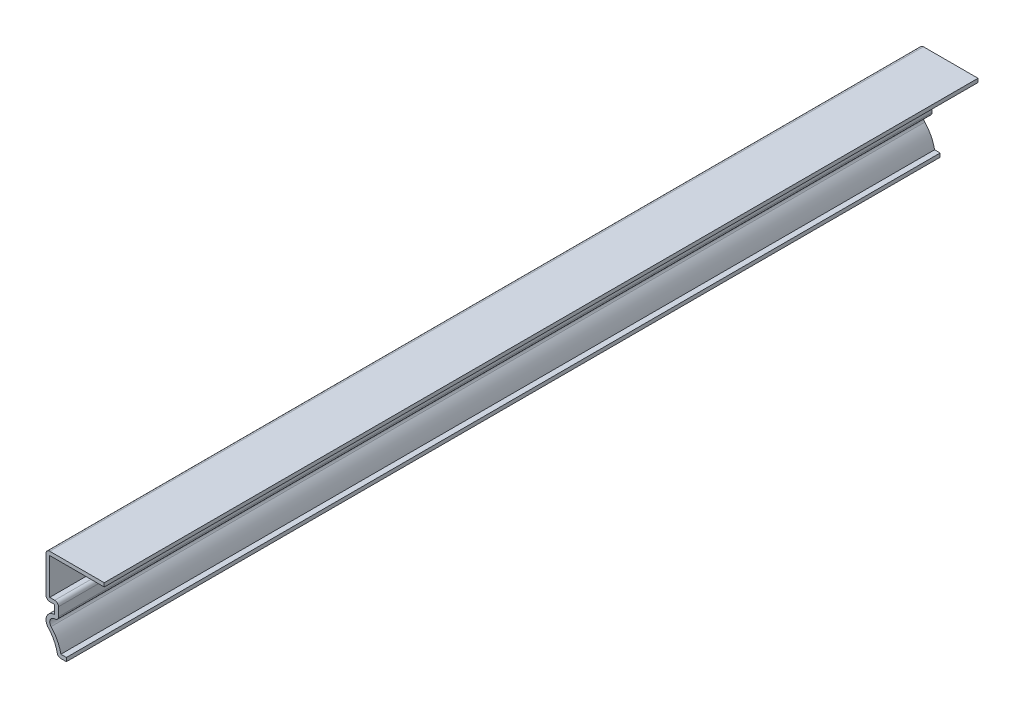
ISO-10303-21;
HEADER;
FILE_DESCRIPTION(('STEP AP214'),'2;1');
FILE_NAME('part.step','',(''),(''),'','','');
FILE_SCHEMA(('AUTOMOTIVE_DESIGN { 1 0 10303 214 1 1 1 1 }'));
ENDSEC;
DATA;
#1=APPLICATION_CONTEXT('core data for automotive mechanical design processes');
#2=APPLICATION_PROTOCOL_DEFINITION('international standard','automotive_design',2000,#1);
#3=PRODUCT_CONTEXT('',#1,'mechanical');
#4=PRODUCT('Part','Part','',(#3));
#5=PRODUCT_RELATED_PRODUCT_CATEGORY('part','',(#4));
#6=PRODUCT_DEFINITION_FORMATION('','',#4);
#7=PRODUCT_DEFINITION_CONTEXT('part definition',#1,'design');
#8=PRODUCT_DEFINITION('design','',#6,#7);
#9=PRODUCT_DEFINITION_SHAPE('','',#8);
#10=(LENGTH_UNIT() NAMED_UNIT(*) SI_UNIT(.MILLI.,.METRE.));
#11=(NAMED_UNIT(*) PLANE_ANGLE_UNIT() SI_UNIT($,.RADIAN.));
#12=(NAMED_UNIT(*) SI_UNIT($,.STERADIAN.) SOLID_ANGLE_UNIT());
#13=UNCERTAINTY_MEASURE_WITH_UNIT(LENGTH_MEASURE(1.E-05),#10,'distance_accuracy_value','');
#14=(GEOMETRIC_REPRESENTATION_CONTEXT(3) GLOBAL_UNCERTAINTY_ASSIGNED_CONTEXT((#13)) GLOBAL_UNIT_ASSIGNED_CONTEXT((#10,
#11,#12)) REPRESENTATION_CONTEXT('',''));
#15=CARTESIAN_POINT('',(0.,0.,0.));
#16=DIRECTION('',(0.,0.,1.));
#17=DIRECTION('',(1.,0.,0.));
#18=AXIS2_PLACEMENT_3D('',#15,#16,#17);
#19=CARTESIAN_POINT('',(0.,22.7965,-238.125));
#20=DIRECTION('',(0.,-1.,0.));
#21=DIRECTION('',(0.,0.,-1.));
#22=AXIS2_PLACEMENT_3D('',#19,#20,#21);
#23=PLANE('',#22);
#24=DIRECTION('',(1.,0.,0.));
#25=VECTOR('',#24,1.);
#26=CARTESIAN_POINT('',(0.,22.7965,0.));
#27=LINE('',#26,#25);
#28=CARTESIAN_POINT('',(-14.859,22.7965,0.));
#29=VERTEX_POINT('',#28);
#30=CARTESIAN_POINT('',(0.,22.7965,0.));
#31=VERTEX_POINT('',#30);
#32=EDGE_CURVE('E241',#29,#31,#27,.T.);
#33=ORIENTED_EDGE('',*,*,#32,.F.);
#34=DIRECTION('',(0.,0.,1.));
#35=VECTOR('',#34,1.);
#36=CARTESIAN_POINT('',(-14.859,22.7965,-238.125));
#37=LINE('',#36,#35);
#38=CARTESIAN_POINT('',(-14.859,22.7965,-238.125));
#39=VERTEX_POINT('',#38);
#40=EDGE_CURVE('E203',#39,#29,#37,.T.);
#41=ORIENTED_EDGE('',*,*,#40,.F.);
#42=DIRECTION('',(1.,0.,0.));
#43=VECTOR('',#42,1.);
#44=CARTESIAN_POINT('',(0.,22.7965,-238.125));
#45=LINE('',#44,#43);
#46=CARTESIAN_POINT('',(0.,22.7965,-238.125));
#47=VERTEX_POINT('',#46);
#48=EDGE_CURVE('E185',#39,#47,#45,.T.);
#49=ORIENTED_EDGE('',*,*,#48,.T.);
#50=DIRECTION('',(0.,0.,1.));
#51=VECTOR('',#50,1.);
#52=CARTESIAN_POINT('',(0.,22.7965,-238.125));
#53=LINE('',#52,#51);
#54=EDGE_CURVE('E193',#47,#31,#53,.T.);
#55=ORIENTED_EDGE('',*,*,#54,.T.);
#56=EDGE_LOOP('',(#33,#41,#49,#55));
#57=FACE_BOUND('',#56,.T.);
#58=ADVANCED_FACE('F35',(#57),#23,.T.);
#59=CARTESIAN_POINT('',(-14.859,23.8125,-238.125));
#60=DIRECTION('',(1.,0.,0.));
#61=DIRECTION('',(0.,1.,0.));
#62=AXIS2_PLACEMENT_3D('',#59,#60,#61);
#63=PLANE('',#62);
#64=DIRECTION('',(0.,1.,0.));
#65=VECTOR('',#64,1.);
#66=CARTESIAN_POINT('',(-14.859,23.8125,0.));
#67=LINE('',#66,#65);
#68=CARTESIAN_POINT('',(-14.859,12.92225,0.));
#69=VERTEX_POINT('',#68);
#70=EDGE_CURVE('E204',#69,#29,#67,.T.);
#71=ORIENTED_EDGE('',*,*,#70,.F.);
#72=DIRECTION('',(0.,0.,1.));
#73=VECTOR('',#72,1.);
#74=CARTESIAN_POINT('',(-14.859,12.92225,-238.125));
#75=LINE('',#74,#73);
#76=CARTESIAN_POINT('',(-14.859,12.92225,-238.125));
#77=VERTEX_POINT('',#76);
#78=EDGE_CURVE('E277',#77,#69,#75,.T.);
#79=ORIENTED_EDGE('',*,*,#78,.F.);
#80=DIRECTION('',(0.,1.,0.));
#81=VECTOR('',#80,1.);
#82=CARTESIAN_POINT('',(-14.859,23.8125,-238.125));
#83=LINE('',#82,#81);
#84=EDGE_CURVE('E201',#77,#39,#83,.T.);
#85=ORIENTED_EDGE('',*,*,#84,.T.);
#86=ORIENTED_EDGE('',*,*,#40,.T.);
#87=EDGE_LOOP('',(#71,#79,#85,#86));
#88=FACE_BOUND('',#87,.T.);
#89=ADVANCED_FACE('F415',(#88),#63,.T.);
#90=CARTESIAN_POINT('',(-15.875,12.92225,-238.125));
#91=DIRECTION('',(0.,1.,0.));
#92=DIRECTION('',(0.,0.,1.));
#93=AXIS2_PLACEMENT_3D('',#90,#91,#92);
#94=PLANE('',#93);
#95=DIRECTION('',(1.,0.,0.));
#96=VECTOR('',#95,1.);
#97=CARTESIAN_POINT('',(-15.875,12.92225,0.));
#98=LINE('',#97,#96);
#99=CARTESIAN_POINT('',(-13.49375,12.92225,0.));
#100=VERTEX_POINT('',#99);
#101=EDGE_CURVE('E207',#100,#69,#98,.F.);
#102=ORIENTED_EDGE('',*,*,#101,.F.);
#103=DIRECTION('',(0.,0.,1.));
#104=VECTOR('',#103,1.);
#105=CARTESIAN_POINT('',(-13.49375,12.92225,-238.125));
#106=LINE('',#105,#104);
#107=CARTESIAN_POINT('',(-13.49375,12.92225,-238.125));
#108=VERTEX_POINT('',#107);
#109=EDGE_CURVE('E43',#100,#108,#106,.F.);
#110=ORIENTED_EDGE('',*,*,#109,.T.);
#111=DIRECTION('',(1.,0.,0.));
#112=VECTOR('',#111,1.);
#113=CARTESIAN_POINT('',(-15.875,12.92225,-238.125));
#114=LINE('',#113,#112);
#115=EDGE_CURVE('E238',#108,#77,#114,.F.);
#116=ORIENTED_EDGE('',*,*,#115,.T.);
#117=ORIENTED_EDGE('',*,*,#78,.T.);
#118=EDGE_LOOP('',(#102,#110,#116,#117));
#119=FACE_BOUND('',#118,.T.);
#120=ADVANCED_FACE('F339',(#119),#94,.T.);
#121=CARTESIAN_POINT('',(-12.47775,11.90625,-238.125));
#122=DIRECTION('',(1.,0.,0.));
#123=DIRECTION('',(0.,1.,0.));
#124=AXIS2_PLACEMENT_3D('',#121,#122,#123);
#125=PLANE('',#124);
#126=DIRECTION('',(0.,1.,0.));
#127=VECTOR('',#126,1.);
#128=CARTESIAN_POINT('',(-12.47775,11.90625,0.));
#129=LINE('',#128,#127);
#130=CARTESIAN_POINT('',(-12.47775,9.525,0.));
#131=VERTEX_POINT('',#130);
#132=CARTESIAN_POINT('',(-12.47775,11.90625,0.));
#133=VERTEX_POINT('',#132);
#134=EDGE_CURVE('E271',#131,#133,#129,.T.);
#135=ORIENTED_EDGE('',*,*,#134,.F.);
#136=DIRECTION('',(0.,0.,1.));
#137=VECTOR('',#136,1.);
#138=CARTESIAN_POINT('',(-12.47775,9.525,-238.125));
#139=LINE('',#138,#137);
#140=CARTESIAN_POINT('',(-12.47775,9.525,-238.125));
#141=VERTEX_POINT('',#140);
#142=EDGE_CURVE('E328',#131,#141,#139,.F.);
#143=ORIENTED_EDGE('',*,*,#142,.T.);
#144=DIRECTION('',(0.,1.,0.));
#145=VECTOR('',#144,1.);
#146=CARTESIAN_POINT('',(-12.47775,11.90625,-238.125));
#147=LINE('',#146,#145);
#148=CARTESIAN_POINT('',(-12.47775,11.90625,-238.125));
#149=VERTEX_POINT('',#148);
#150=EDGE_CURVE('E235',#141,#149,#147,.T.);
#151=ORIENTED_EDGE('',*,*,#150,.T.);
#152=DIRECTION('',(0.,0.,1.));
#153=VECTOR('',#152,1.);
#154=CARTESIAN_POINT('',(-12.47775,11.90625,-238.125));
#155=LINE('',#154,#153);
#156=EDGE_CURVE('E325',#149,#133,#155,.T.);
#157=ORIENTED_EDGE('',*,*,#156,.T.);
#158=EDGE_LOOP('',(#135,#143,#151,#157));
#159=FACE_BOUND('',#158,.T.);
#160=ADVANCED_FACE('F348',(#159),#125,.T.);
#161=CARTESIAN_POINT('',(-13.49375,7.14374999999999,-238.125));
#162=DIRECTION('',(0.,0.,1.));
#163=DIRECTION('',(1.,0.,0.));
#164=AXIS2_PLACEMENT_3D('',#161,#162,#163);
#165=CYLINDRICAL_SURFACE('',#164,1.36525);
#166=CARTESIAN_POINT('',(-13.49375,7.14374999999999,-238.125));
#167=DIRECTION('',(0.,0.,1.));
#168=DIRECTION('',(1.,0.,0.));
#169=AXIS2_PLACEMENT_3D('',#166,#167,#168);
#170=CIRCLE('',#169,1.36525);
#171=CARTESIAN_POINT('',(-14.488796636598,6.20898278111873,-238.125));
#172=VERTEX_POINT('',#171);
#173=CARTESIAN_POINT('',(-13.49375,8.509,-238.125));
#174=VERTEX_POINT('',#173);
#175=EDGE_CURVE('E232',#172,#174,#170,.F.);
#176=ORIENTED_EDGE('',*,*,#175,.T.);
#177=DIRECTION('',(0.,0.,1.));
#178=VECTOR('',#177,1.);
#179=CARTESIAN_POINT('',(-13.49375,8.509,-238.125));
#180=LINE('',#179,#178);
#181=CARTESIAN_POINT('',(-13.49375,8.509,0.));
#182=VERTEX_POINT('',#181);
#183=EDGE_CURVE('E322',#174,#182,#180,.T.);
#184=ORIENTED_EDGE('',*,*,#183,.T.);
#185=CARTESIAN_POINT('',(-13.49375,7.14374999999999,0.));
#186=DIRECTION('',(0.,0.,1.));
#187=DIRECTION('',(1.,0.,0.));
#188=AXIS2_PLACEMENT_3D('',#185,#186,#187);
#189=CIRCLE('',#188,1.36525);
#190=CARTESIAN_POINT('',(-14.488796636598,6.20898278111873,0.));
#191=VERTEX_POINT('',#190);
#192=EDGE_CURVE('E268',#191,#182,#189,.F.);
#193=ORIENTED_EDGE('',*,*,#192,.F.);
#194=DIRECTION('',(0.,0.,1.));
#195=VECTOR('',#194,1.);
#196=CARTESIAN_POINT('',(-14.488796636598,6.20898278111873,-238.125));
#197=LINE('',#196,#195);
#198=EDGE_CURVE('E280',#172,#191,#197,.T.);
#199=ORIENTED_EDGE('',*,*,#198,.F.);
#200=EDGE_LOOP('',(#176,#184,#193,#199));
#201=FACE_BOUND('',#200,.T.);
#202=ADVANCED_FACE('F359',(#201),#165,.F.);
#203=CARTESIAN_POINT('',(-22.1714822959128,-1.00828969954588,-238.125));
#204=DIRECTION('',(0.,0.,1.));
#205=DIRECTION('',(1.,0.,0.));
#206=AXIS2_PLACEMENT_3D('',#203,#204,#205);
#207=CYLINDRICAL_SURFACE('',#206,10.541);
#208=CARTESIAN_POINT('',(-22.1714822959128,-1.00828969954588,0.));
#209=DIRECTION('',(0.,0.,1.));
#210=DIRECTION('',(1.,0.,0.));
#211=AXIS2_PLACEMENT_3D('',#208,#209,#210);
#212=CIRCLE('',#211,10.541);
#213=CARTESIAN_POINT('',(-11.8266801125788,1.016,0.));
#214=VERTEX_POINT('',#213);
#215=EDGE_CURVE('E265',#214,#191,#212,.T.);
#216=ORIENTED_EDGE('',*,*,#215,.F.);
#217=DIRECTION('',(0.,0.,1.));
#218=VECTOR('',#217,1.);
#219=CARTESIAN_POINT('',(-11.8266801125788,1.016,-238.125));
#220=LINE('',#219,#218);
#221=CARTESIAN_POINT('',(-11.8266801125788,1.016,-238.125));
#222=VERTEX_POINT('',#221);
#223=EDGE_CURVE('E282',#222,#214,#220,.T.);
#224=ORIENTED_EDGE('',*,*,#223,.F.);
#225=CARTESIAN_POINT('',(-22.1714822959128,-1.00828969954588,-238.125));
#226=DIRECTION('',(0.,0.,1.));
#227=DIRECTION('',(1.,0.,0.));
#228=AXIS2_PLACEMENT_3D('',#225,#226,#227);
#229=CIRCLE('',#228,10.541);
#230=EDGE_CURVE('E229',#222,#172,#229,.T.);
#231=ORIENTED_EDGE('',*,*,#230,.T.);
#232=ORIENTED_EDGE('',*,*,#198,.T.);
#233=EDGE_LOOP('',(#216,#224,#231,#232));
#234=FACE_BOUND('',#233,.T.);
#235=ADVANCED_FACE('F365',(#234),#207,.T.);
#236=CARTESIAN_POINT('',(-10.31875,1.016,-238.125));
#237=DIRECTION('',(0.,1.,0.));
#238=DIRECTION('',(-1.,0.,0.));
#239=AXIS2_PLACEMENT_3D('',#236,#237,#238);
#240=PLANE('',#239);
#241=DIRECTION('',(-1.,0.,0.));
#242=VECTOR('',#241,1.);
#243=CARTESIAN_POINT('',(-10.31875,1.016,0.));
#244=LINE('',#243,#242);
#245=CARTESIAN_POINT('',(-10.31875,1.016,0.));
#246=VERTEX_POINT('',#245);
#247=EDGE_CURVE('E262',#246,#214,#244,.T.);
#248=ORIENTED_EDGE('',*,*,#247,.F.);
#249=DIRECTION('',(0.,0.,1.));
#250=VECTOR('',#249,1.);
#251=CARTESIAN_POINT('',(-10.31875,1.016,-238.125));
#252=LINE('',#251,#250);
#253=CARTESIAN_POINT('',(-10.31875,1.016,-238.125));
#254=VERTEX_POINT('',#253);
#255=EDGE_CURVE('E284',#254,#246,#252,.T.);
#256=ORIENTED_EDGE('',*,*,#255,.F.);
#257=DIRECTION('',(-1.,0.,0.));
#258=VECTOR('',#257,1.);
#259=CARTESIAN_POINT('',(-10.31875,1.016,-238.125));
#260=LINE('',#259,#258);
#261=EDGE_CURVE('E226',#254,#222,#260,.T.);
#262=ORIENTED_EDGE('',*,*,#261,.T.);
#263=ORIENTED_EDGE('',*,*,#223,.T.);
#264=EDGE_LOOP('',(#248,#256,#262,#263));
#265=FACE_BOUND('',#264,.T.);
#266=ADVANCED_FACE('F368',(#265),#240,.T.);
#267=CARTESIAN_POINT('',(-10.31875,1.016,-238.125));
#268=DIRECTION('',(-1.,0.,0.));
#269=DIRECTION('',(0.,0.,1.));
#270=AXIS2_PLACEMENT_3D('',#267,#268,#269);
#271=PLANE('',#270);
#272=DIRECTION('',(0.,-1.,0.));
#273=VECTOR('',#272,1.);
#274=CARTESIAN_POINT('',(-10.31875,1.016,0.));
#275=LINE('',#274,#273);
#276=CARTESIAN_POINT('',(-10.31875,0.,0.));
#277=VERTEX_POINT('',#276);
#278=EDGE_CURVE('E260',#246,#277,#275,.T.);
#279=ORIENTED_EDGE('',*,*,#278,.T.);
#280=DIRECTION('',(0.,0.,1.));
#281=VECTOR('',#280,1.);
#282=CARTESIAN_POINT('',(-10.31875,0.,-238.125));
#283=LINE('',#282,#281);
#284=CARTESIAN_POINT('',(-10.31875,0.,-238.125));
#285=VERTEX_POINT('',#284);
#286=EDGE_CURVE('E286',#285,#277,#283,.T.);
#287=ORIENTED_EDGE('',*,*,#286,.F.);
#288=DIRECTION('',(0.,-1.,0.));
#289=VECTOR('',#288,1.);
#290=CARTESIAN_POINT('',(-10.31875,1.016,-238.125));
#291=LINE('',#290,#289);
#292=EDGE_CURVE('E224',#254,#285,#291,.T.);
#293=ORIENTED_EDGE('',*,*,#292,.F.);
#294=ORIENTED_EDGE('',*,*,#255,.T.);
#295=EDGE_LOOP('',(#279,#287,#293,#294));
#296=FACE_BOUND('',#295,.T.);
#297=ADVANCED_FACE('F374',(#296),#271,.F.);
#298=CARTESIAN_POINT('',(-10.31875,0.,-238.125));
#299=DIRECTION('',(0.,1.,0.));
#300=DIRECTION('',(-1.,0.,0.));
#301=AXIS2_PLACEMENT_3D('',#298,#299,#300);
#302=PLANE('',#301);
#303=DIRECTION('',(-1.,0.,0.));
#304=VECTOR('',#303,1.);
#305=CARTESIAN_POINT('',(-10.31875,0.,0.));
#306=LINE('',#305,#304);
#307=CARTESIAN_POINT('',(-11.8266801125788,0.,0.));
#308=VERTEX_POINT('',#307);
#309=EDGE_CURVE('E257',#277,#308,#306,.T.);
#310=ORIENTED_EDGE('',*,*,#309,.T.);
#311=DIRECTION('',(0.,0.,1.));
#312=VECTOR('',#311,1.);
#313=CARTESIAN_POINT('',(-11.8266801125788,0.,-238.125));
#314=LINE('',#313,#312);
#315=CARTESIAN_POINT('',(-11.8266801125788,0.,-238.125));
#316=VERTEX_POINT('',#315);
#317=EDGE_CURVE('E311',#308,#316,#314,.F.);
#318=ORIENTED_EDGE('',*,*,#317,.T.);
#319=DIRECTION('',(-1.,0.,0.));
#320=VECTOR('',#319,1.);
#321=CARTESIAN_POINT('',(-10.31875,0.,-238.125));
#322=LINE('',#321,#320);
#323=EDGE_CURVE('E222',#285,#316,#322,.T.);
#324=ORIENTED_EDGE('',*,*,#323,.F.);
#325=ORIENTED_EDGE('',*,*,#286,.T.);
#326=EDGE_LOOP('',(#310,#318,#324,#325));
#327=FACE_BOUND('',#326,.T.);
#328=ADVANCED_FACE('F378',(#327),#302,.F.);
#329=CARTESIAN_POINT('',(-22.1714822959128,-1.00828969954588,-238.125));
#330=DIRECTION('',(0.,0.,1.));
#331=DIRECTION('',(1.,0.,0.));
#332=AXIS2_PLACEMENT_3D('',#329,#330,#331);
#333=CYLINDRICAL_SURFACE('',#332,9.525);
#334=CARTESIAN_POINT('',(-22.1714822959128,-1.00828969954588,-238.125));
#335=DIRECTION('',(0.,0.,1.));
#336=DIRECTION('',(1.,0.,0.));
#337=AXIS2_PLACEMENT_3D('',#334,#335,#336);
#338=CIRCLE('',#337,9.525);
#339=CARTESIAN_POINT('',(-12.8237694796471,0.820887739802807,-238.125));
#340=VERTEX_POINT('',#339);
#341=CARTESIAN_POINT('',(-15.2292964591826,5.51334206009082,-238.125));
#342=VERTEX_POINT('',#341);
#343=EDGE_CURVE('E220',#340,#342,#338,.T.);
#344=ORIENTED_EDGE('',*,*,#343,.F.);
#345=DIRECTION('',(0.,0.,1.));
#346=VECTOR('',#345,1.);
#347=CARTESIAN_POINT('',(-12.8237694796471,0.820887739802807,-238.125));
#348=LINE('',#347,#346);
#349=CARTESIAN_POINT('',(-12.8237694796471,0.820887739802807,0.));
#350=VERTEX_POINT('',#349);
#351=EDGE_CURVE('E276',#340,#350,#348,.T.);
#352=ORIENTED_EDGE('',*,*,#351,.T.);
#353=CARTESIAN_POINT('',(-22.1714822959128,-1.00828969954588,0.));
#354=DIRECTION('',(0.,0.,1.));
#355=DIRECTION('',(1.,0.,0.));
#356=AXIS2_PLACEMENT_3D('',#353,#354,#355);
#357=CIRCLE('',#356,9.525);
#358=CARTESIAN_POINT('',(-15.2292964591826,5.51334206009082,0.));
#359=VERTEX_POINT('',#358);
#360=EDGE_CURVE('E255',#350,#359,#357,.T.);
#361=ORIENTED_EDGE('',*,*,#360,.T.);
#362=DIRECTION('',(0.,0.,1.));
#363=VECTOR('',#362,1.);
#364=CARTESIAN_POINT('',(-15.2292964591826,5.51334206009082,-238.125));
#365=LINE('',#364,#363);
#366=EDGE_CURVE('E289',#342,#359,#365,.T.);
#367=ORIENTED_EDGE('',*,*,#366,.F.);
#368=EDGE_LOOP('',(#344,#352,#361,#367));
#369=FACE_BOUND('',#368,.T.);
#370=ADVANCED_FACE('F386',(#369),#333,.F.);
#371=CARTESIAN_POINT('',(-13.49375,7.14374999999999,-238.125));
#372=DIRECTION('',(0.,0.,1.));
#373=DIRECTION('',(1.,0.,0.));
#374=AXIS2_PLACEMENT_3D('',#371,#372,#373);
#375=CYLINDRICAL_SURFACE('',#374,2.38125);
#376=CARTESIAN_POINT('',(-13.49375,7.14374999999999,0.));
#377=DIRECTION('',(0.,0.,-1.));
#378=DIRECTION('',(1.,0.,0.));
#379=AXIS2_PLACEMENT_3D('',#376,#377,#378);
#380=CIRCLE('',#379,2.38125);
#381=CARTESIAN_POINT('',(-13.49375,9.525,0.));
#382=VERTEX_POINT('',#381);
#383=EDGE_CURVE('E253',#359,#382,#380,.T.);
#384=ORIENTED_EDGE('',*,*,#383,.T.);
#385=DIRECTION('',(0.,0.,1.));
#386=VECTOR('',#385,1.);
#387=CARTESIAN_POINT('',(-13.49375,9.525,-238.125));
#388=LINE('',#387,#386);
#389=CARTESIAN_POINT('',(-13.49375,9.525,-238.125));
#390=VERTEX_POINT('',#389);
#391=EDGE_CURVE('E292',#390,#382,#388,.T.);
#392=ORIENTED_EDGE('',*,*,#391,.F.);
#393=CARTESIAN_POINT('',(-13.49375,7.14374999999999,-238.125));
#394=DIRECTION('',(0.,0.,-1.));
#395=DIRECTION('',(1.,0.,0.));
#396=AXIS2_PLACEMENT_3D('',#393,#394,#395);
#397=CIRCLE('',#396,2.38125);
#398=EDGE_CURVE('E218',#342,#390,#397,.T.);
#399=ORIENTED_EDGE('',*,*,#398,.F.);
#400=ORIENTED_EDGE('',*,*,#366,.T.);
#401=EDGE_LOOP('',(#384,#392,#399,#400));
#402=FACE_BOUND('',#401,.T.);
#403=ADVANCED_FACE('F391',(#402),#375,.T.);
#404=CARTESIAN_POINT('',(-13.49375,11.90625,-238.125));
#405=DIRECTION('',(1.,0.,0.));
#406=DIRECTION('',(0.,1.,0.));
#407=AXIS2_PLACEMENT_3D('',#404,#405,#406);
#408=PLANE('',#407);
#409=DIRECTION('',(0.,1.,0.));
#410=VECTOR('',#409,1.);
#411=CARTESIAN_POINT('',(-13.49375,11.90625,0.));
#412=LINE('',#411,#410);
#413=CARTESIAN_POINT('',(-13.49375,11.90625,0.));
#414=VERTEX_POINT('',#413);
#415=EDGE_CURVE('E251',#382,#414,#412,.T.);
#416=ORIENTED_EDGE('',*,*,#415,.T.);
#417=DIRECTION('',(0.,0.,1.));
#418=VECTOR('',#417,1.);
#419=CARTESIAN_POINT('',(-13.49375,11.90625,-238.125));
#420=LINE('',#419,#418);
#421=CARTESIAN_POINT('',(-13.49375,11.90625,-238.125));
#422=VERTEX_POINT('',#421);
#423=EDGE_CURVE('E295',#422,#414,#420,.T.);
#424=ORIENTED_EDGE('',*,*,#423,.F.);
#425=DIRECTION('',(0.,1.,0.));
#426=VECTOR('',#425,1.);
#427=CARTESIAN_POINT('',(-13.49375,11.90625,-238.125));
#428=LINE('',#427,#426);
#429=EDGE_CURVE('E216',#390,#422,#428,.T.);
#430=ORIENTED_EDGE('',*,*,#429,.F.);
#431=ORIENTED_EDGE('',*,*,#391,.T.);
#432=EDGE_LOOP('',(#416,#424,#430,#431));
#433=FACE_BOUND('',#432,.T.);
#434=ADVANCED_FACE('F397',(#433),#408,.F.);
#435=CARTESIAN_POINT('',(-15.875,11.90625,-238.125));
#436=DIRECTION('',(0.,1.,0.));
#437=DIRECTION('',(0.,0.,1.));
#438=AXIS2_PLACEMENT_3D('',#435,#436,#437);
#439=PLANE('',#438);
#440=DIRECTION('',(-1.,0.,0.));
#441=VECTOR('',#440,1.);
#442=CARTESIAN_POINT('',(-15.875,11.90625,0.));
#443=LINE('',#442,#441);
#444=CARTESIAN_POINT('',(-14.859,11.90625,0.));
#445=VERTEX_POINT('',#444);
#446=EDGE_CURVE('E248',#414,#445,#443,.T.);
#447=ORIENTED_EDGE('',*,*,#446,.T.);
#448=DIRECTION('',(0.,0.,1.));
#449=VECTOR('',#448,1.);
#450=CARTESIAN_POINT('',(-14.859,11.90625,-238.125));
#451=LINE('',#450,#449);
#452=CARTESIAN_POINT('',(-14.859,11.90625,-238.125));
#453=VERTEX_POINT('',#452);
#454=EDGE_CURVE('E334',#445,#453,#451,.F.);
#455=ORIENTED_EDGE('',*,*,#454,.T.);
#456=DIRECTION('',(-1.,0.,0.));
#457=VECTOR('',#456,1.);
#458=CARTESIAN_POINT('',(-15.875,11.90625,-238.125));
#459=LINE('',#458,#457);
#460=EDGE_CURVE('E213',#422,#453,#459,.T.);
#461=ORIENTED_EDGE('',*,*,#460,.F.);
#462=ORIENTED_EDGE('',*,*,#423,.T.);
#463=EDGE_LOOP('',(#447,#455,#461,#462));
#464=FACE_BOUND('',#463,.T.);
#465=ADVANCED_FACE('F401',(#464),#439,.F.);
#466=CARTESIAN_POINT('',(-15.875,23.8125,-238.125));
#467=DIRECTION('',(1.,0.,0.));
#468=DIRECTION('',(0.,1.,0.));
#469=AXIS2_PLACEMENT_3D('',#466,#467,#468);
#470=PLANE('',#469);
#471=DIRECTION('',(0.,1.,0.));
#472=VECTOR('',#471,1.);
#473=CARTESIAN_POINT('',(-15.875,23.8125,-238.125));
#474=LINE('',#473,#472);
#475=CARTESIAN_POINT('',(-15.875,12.92225,-238.125));
#476=VERTEX_POINT('',#475);
#477=CARTESIAN_POINT('',(-15.875,22.7965,-238.125));
#478=VERTEX_POINT('',#477);
#479=EDGE_CURVE('E211',#476,#478,#474,.T.);
#480=ORIENTED_EDGE('',*,*,#479,.F.);
#481=DIRECTION('',(0.,0.,1.));
#482=VECTOR('',#481,1.);
#483=CARTESIAN_POINT('',(-15.875,12.92225,-238.125));
#484=LINE('',#483,#482);
#485=CARTESIAN_POINT('',(-15.875,12.92225,0.));
#486=VERTEX_POINT('',#485);
#487=EDGE_CURVE('E331',#476,#486,#484,.T.);
#488=ORIENTED_EDGE('',*,*,#487,.T.);
#489=DIRECTION('',(0.,1.,0.));
#490=VECTOR('',#489,1.);
#491=CARTESIAN_POINT('',(-15.875,23.8125,0.));
#492=LINE('',#491,#490);
#493=CARTESIAN_POINT('',(-15.875,22.7965,0.));
#494=VERTEX_POINT('',#493);
#495=EDGE_CURVE('E246',#486,#494,#492,.T.);
#496=ORIENTED_EDGE('',*,*,#495,.T.);
#497=DIRECTION('',(0.,0.,1.));
#498=VECTOR('',#497,1.);
#499=CARTESIAN_POINT('',(-15.875,22.7965,-238.125));
#500=LINE('',#499,#498);
#501=EDGE_CURVE('E58',#494,#478,#500,.F.);
#502=ORIENTED_EDGE('',*,*,#501,.T.);
#503=EDGE_LOOP('',(#480,#488,#496,#502));
#504=FACE_BOUND('',#503,.T.);
#505=ADVANCED_FACE('F406',(#504),#470,.F.);
#506=CARTESIAN_POINT('',(0.,23.8125,-238.125));
#507=DIRECTION('',(0.,-1.,0.));
#508=DIRECTION('',(0.,0.,-1.));
#509=AXIS2_PLACEMENT_3D('',#506,#507,#508);
#510=PLANE('',#509);
#511=DIRECTION('',(1.,0.,0.));
#512=VECTOR('',#511,1.);
#513=CARTESIAN_POINT('',(0.,23.8125,-238.125));
#514=LINE('',#513,#512);
#515=CARTESIAN_POINT('',(-14.859,23.8125,-238.125));
#516=VERTEX_POINT('',#515);
#517=CARTESIAN_POINT('',(0.,23.8125,-238.125));
#518=VERTEX_POINT('',#517);
#519=EDGE_CURVE('E187',#516,#518,#514,.T.);
#520=ORIENTED_EDGE('',*,*,#519,.F.);
#521=DIRECTION('',(0.,0.,1.));
#522=VECTOR('',#521,1.);
#523=CARTESIAN_POINT('',(-14.859,23.8125,-238.125));
#524=LINE('',#523,#522);
#525=CARTESIAN_POINT('',(-14.859,23.8125,0.));
#526=VERTEX_POINT('',#525);
#527=EDGE_CURVE('E11',#516,#526,#524,.T.);
#528=ORIENTED_EDGE('',*,*,#527,.T.);
#529=DIRECTION('',(1.,0.,0.));
#530=VECTOR('',#529,1.);
#531=CARTESIAN_POINT('',(0.,23.8125,0.));
#532=LINE('',#531,#530);
#533=CARTESIAN_POINT('',(0.,23.8125,0.));
#534=VERTEX_POINT('',#533);
#535=EDGE_CURVE('E244',#526,#534,#532,.T.);
#536=ORIENTED_EDGE('',*,*,#535,.T.);
#537=DIRECTION('',(0.,0.,1.));
#538=VECTOR('',#537,1.);
#539=CARTESIAN_POINT('',(0.,23.8125,-238.125));
#540=LINE('',#539,#538);
#541=EDGE_CURVE('E200',#518,#534,#540,.T.);
#542=ORIENTED_EDGE('',*,*,#541,.F.);
#543=EDGE_LOOP('',(#520,#528,#536,#542));
#544=FACE_BOUND('',#543,.T.);
#545=ADVANCED_FACE('F412',(#544),#510,.F.);
#546=CARTESIAN_POINT('',(0.,23.8125,-238.125));
#547=DIRECTION('',(-1.,0.,0.));
#548=DIRECTION('',(0.,0.,1.));
#549=AXIS2_PLACEMENT_3D('',#546,#547,#548);
#550=PLANE('',#549);
#551=DIRECTION('',(0.,-1.,0.));
#552=VECTOR('',#551,1.);
#553=CARTESIAN_POINT('',(0.,23.8125,0.));
#554=LINE('',#553,#552);
#555=EDGE_CURVE('E196',#534,#31,#554,.T.);
#556=ORIENTED_EDGE('',*,*,#555,.T.);
#557=ORIENTED_EDGE('',*,*,#54,.F.);
#558=DIRECTION('',(0.,-1.,0.));
#559=VECTOR('',#558,1.);
#560=CARTESIAN_POINT('',(0.,23.8125,-238.125));
#561=LINE('',#560,#559);
#562=EDGE_CURVE('E179',#518,#47,#561,.T.);
#563=ORIENTED_EDGE('',*,*,#562,.F.);
#564=ORIENTED_EDGE('',*,*,#541,.T.);
#565=EDGE_LOOP('',(#556,#557,#563,#564));
#566=FACE_BOUND('',#565,.T.);
#567=ADVANCED_FACE('F194',(#566),#550,.F.);
#568=CARTESIAN_POINT('',(-13.49375,7.14374999999999,-238.125));
#569=DIRECTION('',(0.,0.,-1.));
#570=DIRECTION('',(-1.,0.,0.));
#571=AXIS2_PLACEMENT_3D('',#568,#569,#570);
#572=PLANE('',#571);
#573=ORIENTED_EDGE('',*,*,#323,.T.);
#574=CARTESIAN_POINT('',(-11.8266801125788,1.016,-238.125));
#575=DIRECTION('',(0.,0.,-1.));
#576=DIRECTION('',(-1.,0.,0.));
#577=AXIS2_PLACEMENT_3D('',#574,#575,#576);
#578=CIRCLE('',#577,1.016);
#579=EDGE_CURVE('E320',#316,#340,#578,.T.);
#580=ORIENTED_EDGE('',*,*,#579,.T.);
#581=ORIENTED_EDGE('',*,*,#343,.T.);
#582=ORIENTED_EDGE('',*,*,#398,.T.);
#583=ORIENTED_EDGE('',*,*,#429,.T.);
#584=ORIENTED_EDGE('',*,*,#460,.T.);
#585=CARTESIAN_POINT('',(-14.859,12.92225,-238.125));
#586=DIRECTION('',(0.,0.,-1.));
#587=DIRECTION('',(-1.,0.,0.));
#588=AXIS2_PLACEMENT_3D('',#585,#586,#587);
#589=CIRCLE('',#588,1.016);
#590=EDGE_CURVE('E316',#453,#476,#589,.T.);
#591=ORIENTED_EDGE('',*,*,#590,.T.);
#592=ORIENTED_EDGE('',*,*,#479,.T.);
#593=CARTESIAN_POINT('',(-14.859,22.7965,-238.125));
#594=DIRECTION('',(0.,0.,-1.));
#595=DIRECTION('',(-1.,0.,0.));
#596=AXIS2_PLACEMENT_3D('',#593,#594,#595);
#597=CIRCLE('',#596,1.016);
#598=EDGE_CURVE('E50',#478,#516,#597,.T.);
#599=ORIENTED_EDGE('',*,*,#598,.T.);
#600=ORIENTED_EDGE('',*,*,#519,.T.);
#601=ORIENTED_EDGE('',*,*,#562,.T.);
#602=ORIENTED_EDGE('',*,*,#48,.F.);
#603=ORIENTED_EDGE('',*,*,#84,.F.);
#604=ORIENTED_EDGE('',*,*,#115,.F.);
#605=CARTESIAN_POINT('',(-13.49375,11.90625,-238.125));
#606=DIRECTION('',(0.,0.,-1.));
#607=DIRECTION('',(-1.,0.,0.));
#608=AXIS2_PLACEMENT_3D('',#605,#606,#607);
#609=CIRCLE('',#608,1.016);
#610=EDGE_CURVE('E314',#108,#149,#609,.T.);
#611=ORIENTED_EDGE('',*,*,#610,.T.);
#612=ORIENTED_EDGE('',*,*,#150,.F.);
#613=CARTESIAN_POINT('',(-13.49375,9.525,-238.125));
#614=DIRECTION('',(0.,0.,-1.));
#615=DIRECTION('',(-1.,0.,0.));
#616=AXIS2_PLACEMENT_3D('',#613,#614,#615);
#617=CIRCLE('',#616,1.016);
#618=EDGE_CURVE('E318',#141,#174,#617,.T.);
#619=ORIENTED_EDGE('',*,*,#618,.T.);
#620=ORIENTED_EDGE('',*,*,#175,.F.);
#621=ORIENTED_EDGE('',*,*,#230,.F.);
#622=ORIENTED_EDGE('',*,*,#261,.F.);
#623=ORIENTED_EDGE('',*,*,#292,.T.);
#624=EDGE_LOOP('',(#573,#580,#581,#582,#583,#584,#591,#592,#599,#600,#601,#602,#603,#604,#611,
#612,#619,#620,#621,#622,#623));
#625=FACE_BOUND('',#624,.T.);
#626=ADVANCED_FACE('F182',(#625),#572,.T.);
#627=CARTESIAN_POINT('',(-13.49375,7.14374999999999,0.));
#628=DIRECTION('',(0.,0.,-1.));
#629=DIRECTION('',(-1.,0.,0.));
#630=AXIS2_PLACEMENT_3D('',#627,#628,#629);
#631=PLANE('',#630);
#632=ORIENTED_EDGE('',*,*,#360,.F.);
#633=CARTESIAN_POINT('',(-11.8266801125788,1.016,0.));
#634=DIRECTION('',(0.,0.,-1.));
#635=DIRECTION('',(-1.,0.,0.));
#636=AXIS2_PLACEMENT_3D('',#633,#634,#635);
#637=CIRCLE('',#636,1.016);
#638=EDGE_CURVE('E309',#350,#308,#637,.F.);
#639=ORIENTED_EDGE('',*,*,#638,.T.);
#640=ORIENTED_EDGE('',*,*,#309,.F.);
#641=ORIENTED_EDGE('',*,*,#278,.F.);
#642=ORIENTED_EDGE('',*,*,#247,.T.);
#643=ORIENTED_EDGE('',*,*,#215,.T.);
#644=ORIENTED_EDGE('',*,*,#192,.T.);
#645=CARTESIAN_POINT('',(-13.49375,9.525,0.));
#646=DIRECTION('',(0.,0.,-1.));
#647=DIRECTION('',(-1.,0.,0.));
#648=AXIS2_PLACEMENT_3D('',#645,#646,#647);
#649=CIRCLE('',#648,1.016);
#650=EDGE_CURVE('E307',#182,#131,#649,.F.);
#651=ORIENTED_EDGE('',*,*,#650,.T.);
#652=ORIENTED_EDGE('',*,*,#134,.T.);
#653=CARTESIAN_POINT('',(-13.49375,11.90625,0.));
#654=DIRECTION('',(0.,0.,-1.));
#655=DIRECTION('',(-1.,0.,0.));
#656=AXIS2_PLACEMENT_3D('',#653,#654,#655);
#657=CIRCLE('',#656,1.016);
#658=EDGE_CURVE('E303',#133,#100,#657,.F.);
#659=ORIENTED_EDGE('',*,*,#658,.T.);
#660=ORIENTED_EDGE('',*,*,#101,.T.);
#661=ORIENTED_EDGE('',*,*,#70,.T.);
#662=ORIENTED_EDGE('',*,*,#32,.T.);
#663=ORIENTED_EDGE('',*,*,#555,.F.);
#664=ORIENTED_EDGE('',*,*,#535,.F.);
#665=CARTESIAN_POINT('',(-14.859,22.7965,0.));
#666=DIRECTION('',(0.,0.,-1.));
#667=DIRECTION('',(-1.,0.,0.));
#668=AXIS2_PLACEMENT_3D('',#665,#666,#667);
#669=CIRCLE('',#668,1.016);
#670=EDGE_CURVE('E301',#526,#494,#669,.F.);
#671=ORIENTED_EDGE('',*,*,#670,.T.);
#672=ORIENTED_EDGE('',*,*,#495,.F.);
#673=CARTESIAN_POINT('',(-14.859,12.92225,0.));
#674=DIRECTION('',(0.,0.,-1.));
#675=DIRECTION('',(-1.,0.,0.));
#676=AXIS2_PLACEMENT_3D('',#673,#674,#675);
#677=CIRCLE('',#676,1.016);
#678=EDGE_CURVE('E305',#486,#445,#677,.F.);
#679=ORIENTED_EDGE('',*,*,#678,.T.);
#680=ORIENTED_EDGE('',*,*,#446,.F.);
#681=ORIENTED_EDGE('',*,*,#415,.F.);
#682=ORIENTED_EDGE('',*,*,#383,.F.);
#683=EDGE_LOOP('',(#632,#639,#640,#641,#642,#643,#644,#651,#652,#659,#660,#661,#662,#663,#664,
#671,#672,#679,#680,#681,#682));
#684=FACE_BOUND('',#683,.T.);
#685=ADVANCED_FACE('F352',(#684),#631,.F.);
#686=CARTESIAN_POINT('',(-11.8266801125788,1.016,-238.125));
#687=DIRECTION('',(0.,0.,1.));
#688=DIRECTION('',(1.,0.,0.));
#689=AXIS2_PLACEMENT_3D('',#686,#687,#688);
#690=CYLINDRICAL_SURFACE('',#689,1.016);
#691=ORIENTED_EDGE('',*,*,#579,.F.);
#692=ORIENTED_EDGE('',*,*,#317,.F.);
#693=ORIENTED_EDGE('',*,*,#638,.F.);
#694=ORIENTED_EDGE('',*,*,#351,.F.);
#695=EDGE_LOOP('',(#691,#692,#693,#694));
#696=FACE_BOUND('',#695,.T.);
#697=ADVANCED_FACE('F381',(#696),#690,.T.);
#698=CARTESIAN_POINT('',(-13.49375,9.525,-238.125));
#699=DIRECTION('',(0.,0.,1.));
#700=DIRECTION('',(1.,0.,0.));
#701=AXIS2_PLACEMENT_3D('',#698,#699,#700);
#702=CYLINDRICAL_SURFACE('',#701,1.016);
#703=ORIENTED_EDGE('',*,*,#618,.F.);
#704=ORIENTED_EDGE('',*,*,#142,.F.);
#705=ORIENTED_EDGE('',*,*,#650,.F.);
#706=ORIENTED_EDGE('',*,*,#183,.F.);
#707=EDGE_LOOP('',(#703,#704,#705,#706));
#708=FACE_BOUND('',#707,.T.);
#709=ADVANCED_FACE('F357',(#708),#702,.T.);
#710=CARTESIAN_POINT('',(-14.859,12.92225,-238.125));
#711=DIRECTION('',(0.,0.,1.));
#712=DIRECTION('',(1.,0.,0.));
#713=AXIS2_PLACEMENT_3D('',#710,#711,#712);
#714=CYLINDRICAL_SURFACE('',#713,1.016);
#715=ORIENTED_EDGE('',*,*,#590,.F.);
#716=ORIENTED_EDGE('',*,*,#454,.F.);
#717=ORIENTED_EDGE('',*,*,#678,.F.);
#718=ORIENTED_EDGE('',*,*,#487,.F.);
#719=EDGE_LOOP('',(#715,#716,#717,#718));
#720=FACE_BOUND('',#719,.T.);
#721=ADVANCED_FACE('F404',(#720),#714,.T.);
#722=CARTESIAN_POINT('',(-13.49375,11.90625,-238.125));
#723=DIRECTION('',(0.,0.,1.));
#724=DIRECTION('',(1.,0.,0.));
#725=AXIS2_PLACEMENT_3D('',#722,#723,#724);
#726=CYLINDRICAL_SURFACE('',#725,1.016);
#727=ORIENTED_EDGE('',*,*,#610,.F.);
#728=ORIENTED_EDGE('',*,*,#109,.F.);
#729=ORIENTED_EDGE('',*,*,#658,.F.);
#730=ORIENTED_EDGE('',*,*,#156,.F.);
#731=EDGE_LOOP('',(#727,#728,#729,#730));
#732=FACE_BOUND('',#731,.T.);
#733=ADVANCED_FACE('F345',(#732),#726,.T.);
#734=CARTESIAN_POINT('',(-14.859,22.7965,-238.125));
#735=DIRECTION('',(0.,0.,1.));
#736=DIRECTION('',(1.,0.,0.));
#737=AXIS2_PLACEMENT_3D('',#734,#735,#736);
#738=CYLINDRICAL_SURFACE('',#737,1.016);
#739=ORIENTED_EDGE('',*,*,#598,.F.);
#740=ORIENTED_EDGE('',*,*,#501,.F.);
#741=ORIENTED_EDGE('',*,*,#670,.F.);
#742=ORIENTED_EDGE('',*,*,#527,.F.);
#743=EDGE_LOOP('',(#739,#740,#741,#742));
#744=FACE_BOUND('',#743,.T.);
#745=ADVANCED_FACE('F37',(#744),#738,.T.);
#746=CLOSED_SHELL('',(#58,#89,#120,#160,#202,#235,#266,#297,#328,#370,#403,#434,#465,#505,#545,
#567,#626,#685,#697,#709,#721,#733,#745));
#747=MANIFOLD_SOLID_BREP('B2',#746);
#748=ADVANCED_BREP_SHAPE_REPRESENTATION('',(#18,#747),#14);
#749=SHAPE_DEFINITION_REPRESENTATION(#9,#748);
ENDSEC;
END-ISO-10303-21;
